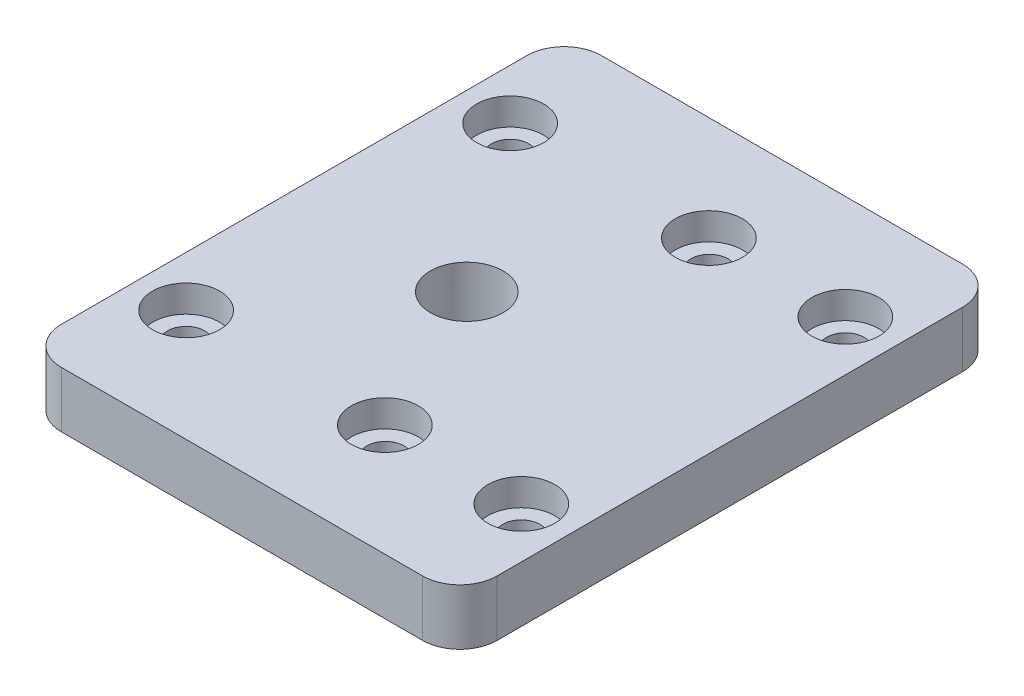
ISO-10303-21;
HEADER;
FILE_DESCRIPTION(('STEP AP214'),'2;1');
FILE_NAME('part.step','',(''),(''),'','','');
FILE_SCHEMA(('AUTOMOTIVE_DESIGN { 1 0 10303 214 1 1 1 1 }'));
ENDSEC;
DATA;
#1=APPLICATION_CONTEXT('core data for automotive mechanical design processes');
#2=APPLICATION_PROTOCOL_DEFINITION('international standard','automotive_design',2000,#1);
#3=PRODUCT_CONTEXT('',#1,'mechanical');
#4=PRODUCT('Part','Part','',(#3));
#5=PRODUCT_RELATED_PRODUCT_CATEGORY('part','',(#4));
#6=PRODUCT_DEFINITION_FORMATION('','',#4);
#7=PRODUCT_DEFINITION_CONTEXT('part definition',#1,'design');
#8=PRODUCT_DEFINITION('design','',#6,#7);
#9=PRODUCT_DEFINITION_SHAPE('','',#8);
#10=(LENGTH_UNIT() NAMED_UNIT(*) SI_UNIT(.MILLI.,.METRE.));
#11=(NAMED_UNIT(*) PLANE_ANGLE_UNIT() SI_UNIT($,.RADIAN.));
#12=(NAMED_UNIT(*) SI_UNIT($,.STERADIAN.) SOLID_ANGLE_UNIT());
#13=UNCERTAINTY_MEASURE_WITH_UNIT(LENGTH_MEASURE(1.E-05),#10,'distance_accuracy_value','');
#14=(GEOMETRIC_REPRESENTATION_CONTEXT(3) GLOBAL_UNCERTAINTY_ASSIGNED_CONTEXT((#13)) GLOBAL_UNIT_ASSIGNED_CONTEXT((#10,
#11,#12)) REPRESENTATION_CONTEXT('',''));
#15=CARTESIAN_POINT('',(0.,0.,0.));
#16=DIRECTION('',(0.,0.,1.));
#17=DIRECTION('',(1.,0.,0.));
#18=AXIS2_PLACEMENT_3D('',#15,#16,#17);
#19=CARTESIAN_POINT('',(-9.,-7.,-8.9));
#20=DIRECTION('',(0.,1.,0.));
#21=DIRECTION('',(0.,0.,1.));
#22=AXIS2_PLACEMENT_3D('',#19,#20,#21);
#23=CYLINDRICAL_SURFACE('',#22,1.);
#24=CARTESIAN_POINT('',(-9.,0.,-8.9));
#25=DIRECTION('',(0.,-1.,0.));
#26=DIRECTION('',(0.,0.,-1.));
#27=AXIS2_PLACEMENT_3D('',#24,#25,#26);
#28=CIRCLE('',#27,1.);
#29=CARTESIAN_POINT('',(-9.,0.,-9.9));
#30=VERTEX_POINT('',#29);
#31=EDGE_CURVE('E167',#30,#30,#28,.T.);
#32=ORIENTED_EDGE('',*,*,#31,.T.);
#33=EDGE_LOOP('',(#32));
#34=FACE_BOUND('',#33,.T.);
#35=CARTESIAN_POINT('',(-9.,1.55,-8.9));
#36=DIRECTION('',(0.,1.,0.));
#37=DIRECTION('',(0.,0.,1.));
#38=AXIS2_PLACEMENT_3D('',#35,#36,#37);
#39=CIRCLE('',#38,1.);
#40=CARTESIAN_POINT('',(-9.,1.55,-7.9));
#41=VERTEX_POINT('',#40);
#42=EDGE_CURVE('E38',#41,#41,#39,.F.);
#43=ORIENTED_EDGE('',*,*,#42,.F.);
#44=EDGE_LOOP('',(#43));
#45=FACE_BOUND('',#44,.T.);
#46=ADVANCED_FACE('F34',(#34,#45),#23,.F.);
#47=CARTESIAN_POINT('',(1.7,-7.,-8.9));
#48=DIRECTION('',(0.,1.,0.));
#49=DIRECTION('',(0.,0.,1.));
#50=AXIS2_PLACEMENT_3D('',#47,#48,#49);
#51=CYLINDRICAL_SURFACE('',#50,1.);
#52=CARTESIAN_POINT('',(1.7,0.,-8.9));
#53=DIRECTION('',(0.,-1.,0.));
#54=DIRECTION('',(0.,0.,-1.));
#55=AXIS2_PLACEMENT_3D('',#52,#53,#54);
#56=CIRCLE('',#55,1.);
#57=CARTESIAN_POINT('',(1.7,0.,-9.9));
#58=VERTEX_POINT('',#57);
#59=EDGE_CURVE('E163',#58,#58,#56,.T.);
#60=ORIENTED_EDGE('',*,*,#59,.T.);
#61=EDGE_LOOP('',(#60));
#62=FACE_BOUND('',#61,.T.);
#63=CARTESIAN_POINT('',(1.7,1.55,-8.9));
#64=DIRECTION('',(0.,1.,0.));
#65=DIRECTION('',(0.,0.,1.));
#66=AXIS2_PLACEMENT_3D('',#63,#64,#65);
#67=CIRCLE('',#66,1.);
#68=CARTESIAN_POINT('',(1.7,1.55,-7.9));
#69=VERTEX_POINT('',#68);
#70=EDGE_CURVE('E192',#69,#69,#67,.F.);
#71=ORIENTED_EDGE('',*,*,#70,.F.);
#72=EDGE_LOOP('',(#71));
#73=FACE_BOUND('',#72,.T.);
#74=ADVANCED_FACE('F271',(#62,#73),#51,.F.);
#75=CARTESIAN_POINT('',(9.,3.,-8.9));
#76=DIRECTION('',(0.,-1.,0.));
#77=DIRECTION('',(0.,0.,-1.));
#78=AXIS2_PLACEMENT_3D('',#75,#76,#77);
#79=CYLINDRICAL_SURFACE('',#78,1.);
#80=CARTESIAN_POINT('',(9.,0.,-8.9));
#81=DIRECTION('',(0.,1.,0.));
#82=DIRECTION('',(0.,0.,1.));
#83=AXIS2_PLACEMENT_3D('',#80,#81,#82);
#84=CIRCLE('',#83,1.);
#85=CARTESIAN_POINT('',(9.,0.,-7.9));
#86=VERTEX_POINT('',#85);
#87=EDGE_CURVE('E229',#86,#86,#84,.T.);
#88=ORIENTED_EDGE('',*,*,#87,.F.);
#89=EDGE_LOOP('',(#88));
#90=FACE_BOUND('',#89,.T.);
#91=CARTESIAN_POINT('',(9.,1.55,-8.9));
#92=DIRECTION('',(0.,1.,0.));
#93=DIRECTION('',(0.,0.,1.));
#94=AXIS2_PLACEMENT_3D('',#91,#92,#93);
#95=CIRCLE('',#94,1.);
#96=CARTESIAN_POINT('',(9.,1.55,-7.9));
#97=VERTEX_POINT('',#96);
#98=EDGE_CURVE('E188',#97,#97,#95,.T.);
#99=ORIENTED_EDGE('',*,*,#98,.T.);
#100=EDGE_LOOP('',(#99));
#101=FACE_BOUND('',#100,.T.);
#102=ADVANCED_FACE('F277',(#90,#101),#79,.F.);
#103=CARTESIAN_POINT('',(9.,3.,8.5));
#104=DIRECTION('',(0.,-1.,0.));
#105=DIRECTION('',(0.,0.,-1.));
#106=AXIS2_PLACEMENT_3D('',#103,#104,#105);
#107=CYLINDRICAL_SURFACE('',#106,1.);
#108=CARTESIAN_POINT('',(9.,0.,8.5));
#109=DIRECTION('',(0.,1.,0.));
#110=DIRECTION('',(0.,0.,-1.));
#111=AXIS2_PLACEMENT_3D('',#108,#109,#110);
#112=CIRCLE('',#111,1.);
#113=CARTESIAN_POINT('',(9.,0.,7.5));
#114=VERTEX_POINT('',#113);
#115=EDGE_CURVE('E135',#114,#114,#112,.T.);
#116=ORIENTED_EDGE('',*,*,#115,.F.);
#117=EDGE_LOOP('',(#116));
#118=FACE_BOUND('',#117,.T.);
#119=CARTESIAN_POINT('',(9.,1.55,8.5));
#120=DIRECTION('',(0.,1.,0.));
#121=DIRECTION('',(0.,0.,1.));
#122=AXIS2_PLACEMENT_3D('',#119,#120,#121);
#123=CIRCLE('',#122,1.);
#124=CARTESIAN_POINT('',(9.,1.55,9.5));
#125=VERTEX_POINT('',#124);
#126=EDGE_CURVE('E183',#125,#125,#123,.T.);
#127=ORIENTED_EDGE('',*,*,#126,.T.);
#128=EDGE_LOOP('',(#127));
#129=FACE_BOUND('',#128,.T.);
#130=ADVANCED_FACE('F287',(#118,#129),#107,.F.);
#131=CARTESIAN_POINT('',(1.7,3.,8.5));
#132=DIRECTION('',(0.,-1.,0.));
#133=DIRECTION('',(0.,0.,-1.));
#134=AXIS2_PLACEMENT_3D('',#131,#132,#133);
#135=CYLINDRICAL_SURFACE('',#134,1.);
#136=CARTESIAN_POINT('',(1.7,0.,8.5));
#137=DIRECTION('',(0.,1.,0.));
#138=DIRECTION('',(0.,0.,-1.));
#139=AXIS2_PLACEMENT_3D('',#136,#137,#138);
#140=CIRCLE('',#139,1.);
#141=CARTESIAN_POINT('',(1.7,0.,7.5));
#142=VERTEX_POINT('',#141);
#143=EDGE_CURVE('E166',#142,#142,#140,.T.);
#144=ORIENTED_EDGE('',*,*,#143,.F.);
#145=EDGE_LOOP('',(#144));
#146=FACE_BOUND('',#145,.T.);
#147=CARTESIAN_POINT('',(1.7,1.55,8.5));
#148=DIRECTION('',(0.,1.,0.));
#149=DIRECTION('',(0.,0.,1.));
#150=AXIS2_PLACEMENT_3D('',#147,#148,#149);
#151=CIRCLE('',#150,1.);
#152=CARTESIAN_POINT('',(1.7,1.55,9.5));
#153=VERTEX_POINT('',#152);
#154=EDGE_CURVE('E178',#153,#153,#151,.T.);
#155=ORIENTED_EDGE('',*,*,#154,.T.);
#156=EDGE_LOOP('',(#155));
#157=FACE_BOUND('',#156,.T.);
#158=ADVANCED_FACE('F283',(#146,#157),#135,.F.);
#159=CARTESIAN_POINT('',(-9.,3.,8.5));
#160=DIRECTION('',(0.,-1.,0.));
#161=DIRECTION('',(0.,0.,-1.));
#162=AXIS2_PLACEMENT_3D('',#159,#160,#161);
#163=CYLINDRICAL_SURFACE('',#162,1.);
#164=CARTESIAN_POINT('',(-9.,0.,8.5));
#165=DIRECTION('',(0.,1.,0.));
#166=DIRECTION('',(0.,0.,-1.));
#167=AXIS2_PLACEMENT_3D('',#164,#165,#166);
#168=CIRCLE('',#167,1.);
#169=CARTESIAN_POINT('',(-9.,0.,7.5));
#170=VERTEX_POINT('',#169);
#171=EDGE_CURVE('E232',#170,#170,#168,.T.);
#172=ORIENTED_EDGE('',*,*,#171,.F.);
#173=EDGE_LOOP('',(#172));
#174=FACE_BOUND('',#173,.T.);
#175=CARTESIAN_POINT('',(-9.,1.55,8.5));
#176=DIRECTION('',(0.,1.,0.));
#177=DIRECTION('',(0.,0.,1.));
#178=AXIS2_PLACEMENT_3D('',#175,#176,#177);
#179=CIRCLE('',#178,1.);
#180=CARTESIAN_POINT('',(-9.,1.55,9.5));
#181=VERTEX_POINT('',#180);
#182=EDGE_CURVE('E174',#181,#181,#179,.T.);
#183=ORIENTED_EDGE('',*,*,#182,.T.);
#184=EDGE_LOOP('',(#183));
#185=FACE_BOUND('',#184,.T.);
#186=ADVANCED_FACE('F286',(#174,#185),#163,.F.);
#187=CARTESIAN_POINT('',(0.,3.,0.));
#188=DIRECTION('',(0.,-1.,0.));
#189=DIRECTION('',(0.,0.,-1.));
#190=AXIS2_PLACEMENT_3D('',#187,#188,#189);
#191=PLANE('',#190);
#192=CARTESIAN_POINT('',(-9.,3.,-8.9));
#193=DIRECTION('',(0.,1.,0.));
#194=DIRECTION('',(0.,0.,1.));
#195=AXIS2_PLACEMENT_3D('',#192,#193,#194);
#196=CIRCLE('',#195,1.8);
#197=CARTESIAN_POINT('',(-9.,3.,-7.1));
#198=VERTEX_POINT('',#197);
#199=EDGE_CURVE('E208',#198,#198,#196,.T.);
#200=ORIENTED_EDGE('',*,*,#199,.F.);
#201=EDGE_LOOP('',(#200));
#202=FACE_BOUND('',#201,.T.);
#203=CARTESIAN_POINT('',(1.67182258338477,3.,-8.89999999999191));
#204=DIRECTION('',(0.,1.,0.));
#205=DIRECTION('',(0.,0.,1.));
#206=AXIS2_PLACEMENT_3D('',#203,#204,#205);
#207=CIRCLE('',#206,1.80000000000306);
#208=CARTESIAN_POINT('',(1.67182258338477,3.,-7.09999999998885));
#209=VERTEX_POINT('',#208);
#210=EDGE_CURVE('E201',#209,#209,#207,.T.);
#211=ORIENTED_EDGE('',*,*,#210,.F.);
#212=EDGE_LOOP('',(#211));
#213=FACE_BOUND('',#212,.T.);
#214=CARTESIAN_POINT('',(9.,3.,-8.9));
#215=DIRECTION('',(0.,1.,0.));
#216=DIRECTION('',(0.,0.,1.));
#217=AXIS2_PLACEMENT_3D('',#214,#215,#216);
#218=CIRCLE('',#217,1.8);
#219=CARTESIAN_POINT('',(9.,3.,-7.1));
#220=VERTEX_POINT('',#219);
#221=EDGE_CURVE('E194',#220,#220,#218,.T.);
#222=ORIENTED_EDGE('',*,*,#221,.F.);
#223=EDGE_LOOP('',(#222));
#224=FACE_BOUND('',#223,.T.);
#225=CARTESIAN_POINT('',(9.,3.,8.5));
#226=DIRECTION('',(0.,1.,0.));
#227=DIRECTION('',(0.,0.,1.));
#228=AXIS2_PLACEMENT_3D('',#225,#226,#227);
#229=CIRCLE('',#228,1.8);
#230=CARTESIAN_POINT('',(9.,3.,10.3));
#231=VERTEX_POINT('',#230);
#232=EDGE_CURVE('E190',#231,#231,#229,.T.);
#233=ORIENTED_EDGE('',*,*,#232,.F.);
#234=EDGE_LOOP('',(#233));
#235=FACE_BOUND('',#234,.T.);
#236=CARTESIAN_POINT('',(1.67182258337933,3.,8.50000000000803));
#237=DIRECTION('',(0.,1.,0.));
#238=DIRECTION('',(0.,0.,1.));
#239=AXIS2_PLACEMENT_3D('',#236,#237,#238);
#240=CIRCLE('',#239,1.80000000000306);
#241=CARTESIAN_POINT('',(1.67182258337933,3.,10.3000000000111));
#242=VERTEX_POINT('',#241);
#243=EDGE_CURVE('E186',#242,#242,#240,.T.);
#244=ORIENTED_EDGE('',*,*,#243,.F.);
#245=EDGE_LOOP('',(#244));
#246=FACE_BOUND('',#245,.T.);
#247=CARTESIAN_POINT('',(-9.,3.,8.5));
#248=DIRECTION('',(0.,1.,0.));
#249=DIRECTION('',(0.,0.,1.));
#250=AXIS2_PLACEMENT_3D('',#247,#248,#249);
#251=CIRCLE('',#250,1.8);
#252=CARTESIAN_POINT('',(-9.,3.,10.3));
#253=VERTEX_POINT('',#252);
#254=EDGE_CURVE('E181',#253,#253,#251,.T.);
#255=ORIENTED_EDGE('',*,*,#254,.F.);
#256=EDGE_LOOP('',(#255));
#257=FACE_BOUND('',#256,.T.);
#258=CARTESIAN_POINT('',(-2.3281774166205,3.,0.100000000001835));
#259=DIRECTION('',(0.,1.,0.));
#260=DIRECTION('',(0.,0.,1.));
#261=AXIS2_PLACEMENT_3D('',#258,#259,#260);
#262=CIRCLE('',#261,1.95);
#263=CARTESIAN_POINT('',(-2.3281774166205,3.,2.05000000000184));
#264=VERTEX_POINT('',#263);
#265=EDGE_CURVE('E173',#264,#264,#262,.T.);
#266=ORIENTED_EDGE('',*,*,#265,.F.);
#267=EDGE_LOOP('',(#266));
#268=FACE_BOUND('',#267,.T.);
#269=DIRECTION('',(0.,0.,-1.));
#270=VECTOR('',#269,1.);
#271=CARTESIAN_POINT('',(11.7,3.,14.5));
#272=LINE('',#271,#270);
#273=CARTESIAN_POINT('',(11.7,3.,12.5));
#274=VERTEX_POINT('',#273);
#275=CARTESIAN_POINT('',(11.7,3.,-12.5));
#276=VERTEX_POINT('',#275);
#277=EDGE_CURVE('E140',#274,#276,#272,.T.);
#278=ORIENTED_EDGE('',*,*,#277,.T.);
#279=CARTESIAN_POINT('',(9.69999999999999,3.,-12.5));
#280=DIRECTION('',(0.,-1.,0.));
#281=DIRECTION('',(0.,0.,-1.));
#282=AXIS2_PLACEMENT_3D('',#279,#280,#281);
#283=CIRCLE('',#282,2.);
#284=CARTESIAN_POINT('',(9.69999999999999,3.,-14.5));
#285=VERTEX_POINT('',#284);
#286=EDGE_CURVE('E155',#276,#285,#283,.F.);
#287=ORIENTED_EDGE('',*,*,#286,.T.);
#288=DIRECTION('',(-1.,0.,0.));
#289=VECTOR('',#288,1.);
#290=CARTESIAN_POINT('',(-11.7,3.,-14.5));
#291=LINE('',#290,#289);
#292=CARTESIAN_POINT('',(-9.7,3.,-14.5));
#293=VERTEX_POINT('',#292);
#294=EDGE_CURVE('E122',#285,#293,#291,.T.);
#295=ORIENTED_EDGE('',*,*,#294,.T.);
#296=CARTESIAN_POINT('',(-9.7,3.,-12.5));
#297=DIRECTION('',(0.,-1.,0.));
#298=DIRECTION('',(0.,0.,-1.));
#299=AXIS2_PLACEMENT_3D('',#296,#297,#298);
#300=CIRCLE('',#299,2.);
#301=CARTESIAN_POINT('',(-11.7,3.,-12.5));
#302=VERTEX_POINT('',#301);
#303=EDGE_CURVE('E150',#293,#302,#300,.F.);
#304=ORIENTED_EDGE('',*,*,#303,.T.);
#305=DIRECTION('',(0.,0.,1.));
#306=VECTOR('',#305,1.);
#307=CARTESIAN_POINT('',(-11.7,3.,14.5));
#308=LINE('',#307,#306);
#309=CARTESIAN_POINT('',(-11.7,3.,12.5));
#310=VERTEX_POINT('',#309);
#311=EDGE_CURVE('E240',#302,#310,#308,.T.);
#312=ORIENTED_EDGE('',*,*,#311,.T.);
#313=CARTESIAN_POINT('',(-9.7,3.,12.5));
#314=DIRECTION('',(0.,-1.,0.));
#315=DIRECTION('',(0.,0.,-1.));
#316=AXIS2_PLACEMENT_3D('',#313,#314,#315);
#317=CIRCLE('',#316,2.);
#318=CARTESIAN_POINT('',(-9.7,3.,14.5));
#319=VERTEX_POINT('',#318);
#320=EDGE_CURVE('E58',#310,#319,#317,.F.);
#321=ORIENTED_EDGE('',*,*,#320,.T.);
#322=DIRECTION('',(1.,0.,0.));
#323=VECTOR('',#322,1.);
#324=CARTESIAN_POINT('',(-11.7,3.,14.5));
#325=LINE('',#324,#323);
#326=CARTESIAN_POINT('',(9.69999999999999,3.,14.5));
#327=VERTEX_POINT('',#326);
#328=EDGE_CURVE('E141',#319,#327,#325,.T.);
#329=ORIENTED_EDGE('',*,*,#328,.T.);
#330=CARTESIAN_POINT('',(9.7,3.,12.5));
#331=DIRECTION('',(0.,-1.,0.));
#332=DIRECTION('',(0.,0.,-1.));
#333=AXIS2_PLACEMENT_3D('',#330,#331,#332);
#334=CIRCLE('',#333,2.);
#335=EDGE_CURVE('E153',#327,#274,#334,.F.);
#336=ORIENTED_EDGE('',*,*,#335,.T.);
#337=EDGE_LOOP('',(#278,#287,#295,#304,#312,#321,#329,#336));
#338=FACE_BOUND('',#337,.T.);
#339=ADVANCED_FACE('F242',(#202,#213,#224,#235,#246,#257,#268,#338),#191,.F.);
#340=CARTESIAN_POINT('',(0.,0.,0.));
#341=DIRECTION('',(0.,-1.,0.));
#342=DIRECTION('',(0.,0.,-1.));
#343=AXIS2_PLACEMENT_3D('',#340,#341,#342);
#344=PLANE('',#343);
#345=CARTESIAN_POINT('',(-2.3281774166205,0.,0.100000000001835));
#346=DIRECTION('',(0.,-1.,0.));
#347=DIRECTION('',(0.,0.,-1.));
#348=AXIS2_PLACEMENT_3D('',#345,#346,#347);
#349=CIRCLE('',#348,1.95);
#350=CARTESIAN_POINT('',(-2.3281774166205,0.,-1.84999999999817));
#351=VERTEX_POINT('',#350);
#352=EDGE_CURVE('E170',#351,#351,#349,.T.);
#353=ORIENTED_EDGE('',*,*,#352,.F.);
#354=EDGE_LOOP('',(#353));
#355=FACE_BOUND('',#354,.T.);
#356=ORIENTED_EDGE('',*,*,#31,.F.);
#357=EDGE_LOOP('',(#356));
#358=FACE_BOUND('',#357,.T.);
#359=ORIENTED_EDGE('',*,*,#59,.F.);
#360=EDGE_LOOP('',(#359));
#361=FACE_BOUND('',#360,.T.);
#362=ORIENTED_EDGE('',*,*,#87,.T.);
#363=EDGE_LOOP('',(#362));
#364=FACE_BOUND('',#363,.T.);
#365=ORIENTED_EDGE('',*,*,#115,.T.);
#366=EDGE_LOOP('',(#365));
#367=FACE_BOUND('',#366,.T.);
#368=DIRECTION('',(-1.,0.,0.));
#369=VECTOR('',#368,1.);
#370=CARTESIAN_POINT('',(-11.7,0.,-14.5));
#371=LINE('',#370,#369);
#372=CARTESIAN_POINT('',(9.69999999999999,0.,-14.5));
#373=VERTEX_POINT('',#372);
#374=CARTESIAN_POINT('',(-9.7,0.,-14.5));
#375=VERTEX_POINT('',#374);
#376=EDGE_CURVE('E119',#373,#375,#371,.T.);
#377=ORIENTED_EDGE('',*,*,#376,.F.);
#378=CARTESIAN_POINT('',(9.69999999999999,0.,-12.5));
#379=DIRECTION('',(0.,-1.,0.));
#380=DIRECTION('',(0.,0.,-1.));
#381=AXIS2_PLACEMENT_3D('',#378,#379,#380);
#382=CIRCLE('',#381,2.);
#383=CARTESIAN_POINT('',(11.7,0.,-12.5));
#384=VERTEX_POINT('',#383);
#385=EDGE_CURVE('E102',#373,#384,#382,.T.);
#386=ORIENTED_EDGE('',*,*,#385,.T.);
#387=DIRECTION('',(0.,0.,-1.));
#388=VECTOR('',#387,1.);
#389=CARTESIAN_POINT('',(11.7,0.,14.5));
#390=LINE('',#389,#388);
#391=CARTESIAN_POINT('',(11.7,0.,12.5));
#392=VERTEX_POINT('',#391);
#393=EDGE_CURVE('E130',#392,#384,#390,.T.);
#394=ORIENTED_EDGE('',*,*,#393,.F.);
#395=CARTESIAN_POINT('',(9.7,0.,12.5));
#396=DIRECTION('',(0.,-1.,0.));
#397=DIRECTION('',(0.,0.,-1.));
#398=AXIS2_PLACEMENT_3D('',#395,#396,#397);
#399=CIRCLE('',#398,2.);
#400=CARTESIAN_POINT('',(9.69999999999999,0.,14.5));
#401=VERTEX_POINT('',#400);
#402=EDGE_CURVE('E113',#392,#401,#399,.T.);
#403=ORIENTED_EDGE('',*,*,#402,.T.);
#404=DIRECTION('',(1.,0.,0.));
#405=VECTOR('',#404,1.);
#406=CARTESIAN_POINT('',(-11.7,0.,14.5));
#407=LINE('',#406,#405);
#408=CARTESIAN_POINT('',(-9.7,0.,14.5));
#409=VERTEX_POINT('',#408);
#410=EDGE_CURVE('E133',#409,#401,#407,.T.);
#411=ORIENTED_EDGE('',*,*,#410,.F.);
#412=CARTESIAN_POINT('',(-9.7,0.,12.5));
#413=DIRECTION('',(0.,-1.,0.));
#414=DIRECTION('',(0.,0.,-1.));
#415=AXIS2_PLACEMENT_3D('',#412,#413,#414);
#416=CIRCLE('',#415,2.);
#417=CARTESIAN_POINT('',(-11.7,0.,12.5));
#418=VERTEX_POINT('',#417);
#419=EDGE_CURVE('E144',#409,#418,#416,.T.);
#420=ORIENTED_EDGE('',*,*,#419,.T.);
#421=DIRECTION('',(0.,0.,1.));
#422=VECTOR('',#421,1.);
#423=CARTESIAN_POINT('',(-11.7,0.,14.5));
#424=LINE('',#423,#422);
#425=CARTESIAN_POINT('',(-11.7,0.,-12.5));
#426=VERTEX_POINT('',#425);
#427=EDGE_CURVE('E129',#426,#418,#424,.T.);
#428=ORIENTED_EDGE('',*,*,#427,.F.);
#429=CARTESIAN_POINT('',(-9.7,0.,-12.5));
#430=DIRECTION('',(0.,-1.,0.));
#431=DIRECTION('',(0.,0.,-1.));
#432=AXIS2_PLACEMENT_3D('',#429,#430,#431);
#433=CIRCLE('',#432,2.);
#434=EDGE_CURVE('E123',#426,#375,#433,.T.);
#435=ORIENTED_EDGE('',*,*,#434,.T.);
#436=EDGE_LOOP('',(#377,#386,#394,#403,#411,#420,#428,#435));
#437=FACE_BOUND('',#436,.T.);
#438=ORIENTED_EDGE('',*,*,#171,.T.);
#439=EDGE_LOOP('',(#438));
#440=FACE_BOUND('',#439,.T.);
#441=ORIENTED_EDGE('',*,*,#143,.T.);
#442=EDGE_LOOP('',(#441));
#443=FACE_BOUND('',#442,.T.);
#444=ADVANCED_FACE('F126',(#355,#358,#361,#364,#367,#437,#440,#443),#344,.T.);
#445=CARTESIAN_POINT('',(11.7,3.,14.5));
#446=DIRECTION('',(-1.,0.,0.));
#447=DIRECTION('',(0.,0.,1.));
#448=AXIS2_PLACEMENT_3D('',#445,#446,#447);
#449=PLANE('',#448);
#450=ORIENTED_EDGE('',*,*,#393,.T.);
#451=DIRECTION('',(0.,-1.,0.));
#452=VECTOR('',#451,1.);
#453=CARTESIAN_POINT('',(11.7,3.,-12.5));
#454=LINE('',#453,#452);
#455=EDGE_CURVE('E107',#384,#276,#454,.F.);
#456=ORIENTED_EDGE('',*,*,#455,.T.);
#457=ORIENTED_EDGE('',*,*,#277,.F.);
#458=DIRECTION('',(0.,-1.,0.));
#459=VECTOR('',#458,1.);
#460=CARTESIAN_POINT('',(11.7,3.,12.5));
#461=LINE('',#460,#459);
#462=EDGE_CURVE('E112',#274,#392,#461,.T.);
#463=ORIENTED_EDGE('',*,*,#462,.T.);
#464=EDGE_LOOP('',(#450,#456,#457,#463));
#465=FACE_BOUND('',#464,.T.);
#466=ADVANCED_FACE('F249',(#465),#449,.F.);
#467=CARTESIAN_POINT('',(-11.7,3.,-14.5));
#468=DIRECTION('',(0.,0.,1.));
#469=DIRECTION('',(1.,0.,0.));
#470=AXIS2_PLACEMENT_3D('',#467,#468,#469);
#471=PLANE('',#470);
#472=ORIENTED_EDGE('',*,*,#294,.F.);
#473=DIRECTION('',(0.,-1.,0.));
#474=VECTOR('',#473,1.);
#475=CARTESIAN_POINT('',(9.69999999999999,3.,-14.5));
#476=LINE('',#475,#474);
#477=EDGE_CURVE('E106',#285,#373,#476,.T.);
#478=ORIENTED_EDGE('',*,*,#477,.T.);
#479=ORIENTED_EDGE('',*,*,#376,.T.);
#480=DIRECTION('',(0.,-1.,0.));
#481=VECTOR('',#480,1.);
#482=CARTESIAN_POINT('',(-9.7,3.,-14.5));
#483=LINE('',#482,#481);
#484=EDGE_CURVE('E124',#375,#293,#483,.F.);
#485=ORIENTED_EDGE('',*,*,#484,.T.);
#486=EDGE_LOOP('',(#472,#478,#479,#485));
#487=FACE_BOUND('',#486,.T.);
#488=ADVANCED_FACE('F118',(#487),#471,.F.);
#489=CARTESIAN_POINT('',(-11.7,3.,14.5));
#490=DIRECTION('',(1.,0.,0.));
#491=DIRECTION('',(0.,0.,-1.));
#492=AXIS2_PLACEMENT_3D('',#489,#490,#491);
#493=PLANE('',#492);
#494=ORIENTED_EDGE('',*,*,#427,.T.);
#495=DIRECTION('',(0.,-1.,0.));
#496=VECTOR('',#495,1.);
#497=CARTESIAN_POINT('',(-11.7,3.,12.5));
#498=LINE('',#497,#496);
#499=EDGE_CURVE('E11',#418,#310,#498,.F.);
#500=ORIENTED_EDGE('',*,*,#499,.T.);
#501=ORIENTED_EDGE('',*,*,#311,.F.);
#502=DIRECTION('',(0.,-1.,0.));
#503=VECTOR('',#502,1.);
#504=CARTESIAN_POINT('',(-11.7,3.,-12.5));
#505=LINE('',#504,#503);
#506=EDGE_CURVE('E43',#302,#426,#505,.T.);
#507=ORIENTED_EDGE('',*,*,#506,.T.);
#508=EDGE_LOOP('',(#494,#500,#501,#507));
#509=FACE_BOUND('',#508,.T.);
#510=ADVANCED_FACE('F256',(#509),#493,.F.);
#511=CARTESIAN_POINT('',(-11.7,3.,14.5));
#512=DIRECTION('',(0.,0.,-1.));
#513=DIRECTION('',(-1.,0.,0.));
#514=AXIS2_PLACEMENT_3D('',#511,#512,#513);
#515=PLANE('',#514);
#516=ORIENTED_EDGE('',*,*,#410,.T.);
#517=DIRECTION('',(0.,-1.,0.));
#518=VECTOR('',#517,1.);
#519=CARTESIAN_POINT('',(9.69999999999999,3.,14.5));
#520=LINE('',#519,#518);
#521=EDGE_CURVE('E51',#401,#327,#520,.F.);
#522=ORIENTED_EDGE('',*,*,#521,.T.);
#523=ORIENTED_EDGE('',*,*,#328,.F.);
#524=DIRECTION('',(0.,-1.,0.));
#525=VECTOR('',#524,1.);
#526=CARTESIAN_POINT('',(-9.7,3.,14.5));
#527=LINE('',#526,#525);
#528=EDGE_CURVE('E157',#319,#409,#527,.T.);
#529=ORIENTED_EDGE('',*,*,#528,.T.);
#530=EDGE_LOOP('',(#516,#522,#523,#529));
#531=FACE_BOUND('',#530,.T.);
#532=ADVANCED_FACE('F251',(#531),#515,.F.);
#533=CARTESIAN_POINT('',(9.69999999999999,3.,-12.5));
#534=DIRECTION('',(0.,-1.,0.));
#535=DIRECTION('',(0.,0.,-1.));
#536=AXIS2_PLACEMENT_3D('',#533,#534,#535);
#537=CYLINDRICAL_SURFACE('',#536,2.);
#538=ORIENTED_EDGE('',*,*,#286,.F.);
#539=ORIENTED_EDGE('',*,*,#455,.F.);
#540=ORIENTED_EDGE('',*,*,#385,.F.);
#541=ORIENTED_EDGE('',*,*,#477,.F.);
#542=EDGE_LOOP('',(#538,#539,#540,#541));
#543=FACE_BOUND('',#542,.T.);
#544=ADVANCED_FACE('F105',(#543),#537,.T.);
#545=CARTESIAN_POINT('',(9.7,3.,12.5));
#546=DIRECTION('',(0.,-1.,0.));
#547=DIRECTION('',(0.,0.,-1.));
#548=AXIS2_PLACEMENT_3D('',#545,#546,#547);
#549=CYLINDRICAL_SURFACE('',#548,2.);
#550=ORIENTED_EDGE('',*,*,#335,.F.);
#551=ORIENTED_EDGE('',*,*,#521,.F.);
#552=ORIENTED_EDGE('',*,*,#402,.F.);
#553=ORIENTED_EDGE('',*,*,#462,.F.);
#554=EDGE_LOOP('',(#550,#551,#552,#553));
#555=FACE_BOUND('',#554,.T.);
#556=ADVANCED_FACE('F247',(#555),#549,.T.);
#557=CARTESIAN_POINT('',(-9.7,3.,12.5));
#558=DIRECTION('',(0.,-1.,0.));
#559=DIRECTION('',(0.,0.,-1.));
#560=AXIS2_PLACEMENT_3D('',#557,#558,#559);
#561=CYLINDRICAL_SURFACE('',#560,2.);
#562=ORIENTED_EDGE('',*,*,#320,.F.);
#563=ORIENTED_EDGE('',*,*,#499,.F.);
#564=ORIENTED_EDGE('',*,*,#419,.F.);
#565=ORIENTED_EDGE('',*,*,#528,.F.);
#566=EDGE_LOOP('',(#562,#563,#564,#565));
#567=FACE_BOUND('',#566,.T.);
#568=ADVANCED_FACE('F253',(#567),#561,.T.);
#569=CARTESIAN_POINT('',(-9.7,3.,-12.5));
#570=DIRECTION('',(0.,-1.,0.));
#571=DIRECTION('',(0.,0.,-1.));
#572=AXIS2_PLACEMENT_3D('',#569,#570,#571);
#573=CYLINDRICAL_SURFACE('',#572,2.);
#574=ORIENTED_EDGE('',*,*,#303,.F.);
#575=ORIENTED_EDGE('',*,*,#484,.F.);
#576=ORIENTED_EDGE('',*,*,#434,.F.);
#577=ORIENTED_EDGE('',*,*,#506,.F.);
#578=EDGE_LOOP('',(#574,#575,#576,#577));
#579=FACE_BOUND('',#578,.T.);
#580=ADVANCED_FACE('F36',(#579),#573,.T.);
#581=CARTESIAN_POINT('',(-2.3281774166205,-7.,0.100000000001835));
#582=DIRECTION('',(0.,1.,0.));
#583=DIRECTION('',(0.,0.,1.));
#584=AXIS2_PLACEMENT_3D('',#581,#582,#583);
#585=CYLINDRICAL_SURFACE('',#584,1.95);
#586=ORIENTED_EDGE('',*,*,#352,.T.);
#587=EDGE_LOOP('',(#586));
#588=FACE_BOUND('',#587,.T.);
#589=ORIENTED_EDGE('',*,*,#265,.T.);
#590=EDGE_LOOP('',(#589));
#591=FACE_BOUND('',#590,.T.);
#592=ADVANCED_FACE('F262',(#588,#591),#585,.F.);
#593=CARTESIAN_POINT('',(-9.,1.55,8.5));
#594=DIRECTION('',(0.,1.,0.));
#595=DIRECTION('',(0.,0.,1.));
#596=AXIS2_PLACEMENT_3D('',#593,#594,#595);
#597=CYLINDRICAL_SURFACE('',#596,1.8);
#598=CARTESIAN_POINT('',(-9.,1.55,8.5));
#599=DIRECTION('',(0.,1.,0.));
#600=DIRECTION('',(0.,0.,1.));
#601=AXIS2_PLACEMENT_3D('',#598,#599,#600);
#602=CIRCLE('',#601,1.8);
#603=CARTESIAN_POINT('',(-9.,1.55,10.3));
#604=VERTEX_POINT('',#603);
#605=EDGE_CURVE('E177',#604,#604,#602,.T.);
#606=ORIENTED_EDGE('',*,*,#605,.F.);
#607=EDGE_LOOP('',(#606));
#608=FACE_BOUND('',#607,.T.);
#609=ORIENTED_EDGE('',*,*,#254,.T.);
#610=EDGE_LOOP('',(#609));
#611=FACE_BOUND('',#610,.T.);
#612=ADVANCED_FACE('F267',(#608,#611),#597,.F.);
#613=CARTESIAN_POINT('',(-9.,1.55,8.5));
#614=DIRECTION('',(0.,1.,0.));
#615=DIRECTION('',(0.,0.,1.));
#616=AXIS2_PLACEMENT_3D('',#613,#614,#615);
#617=PLANE('',#616);
#618=ORIENTED_EDGE('',*,*,#182,.F.);
#619=EDGE_LOOP('',(#618));
#620=FACE_BOUND('',#619,.T.);
#621=ORIENTED_EDGE('',*,*,#605,.T.);
#622=EDGE_LOOP('',(#621));
#623=FACE_BOUND('',#622,.T.);
#624=ADVANCED_FACE('F390',(#620,#623),#617,.T.);
#625=CARTESIAN_POINT('',(1.67182258337933,1.55,8.50000000000803));
#626=DIRECTION('',(0.,1.,0.));
#627=DIRECTION('',(0.,0.,1.));
#628=AXIS2_PLACEMENT_3D('',#625,#626,#627);
#629=CYLINDRICAL_SURFACE('',#628,1.80000000000306);
#630=CARTESIAN_POINT('',(1.67182258337933,1.55,8.50000000000803));
#631=DIRECTION('',(0.,1.,0.));
#632=DIRECTION('',(0.,0.,1.));
#633=AXIS2_PLACEMENT_3D('',#630,#631,#632);
#634=CIRCLE('',#633,1.80000000000306);
#635=CARTESIAN_POINT('',(1.67182258337933,1.55,10.3000000000111));
#636=VERTEX_POINT('',#635);
#637=EDGE_CURVE('E182',#636,#636,#634,.T.);
#638=ORIENTED_EDGE('',*,*,#637,.F.);
#639=EDGE_LOOP('',(#638));
#640=FACE_BOUND('',#639,.T.);
#641=ORIENTED_EDGE('',*,*,#243,.T.);
#642=EDGE_LOOP('',(#641));
#643=FACE_BOUND('',#642,.T.);
#644=ADVANCED_FACE('F399',(#640,#643),#629,.F.);
#645=CARTESIAN_POINT('',(1.67182258337933,1.55,8.50000000000803));
#646=DIRECTION('',(0.,1.,0.));
#647=DIRECTION('',(0.,0.,1.));
#648=AXIS2_PLACEMENT_3D('',#645,#646,#647);
#649=PLANE('',#648);
#650=ORIENTED_EDGE('',*,*,#154,.F.);
#651=EDGE_LOOP('',(#650));
#652=FACE_BOUND('',#651,.T.);
#653=ORIENTED_EDGE('',*,*,#637,.T.);
#654=EDGE_LOOP('',(#653));
#655=FACE_BOUND('',#654,.T.);
#656=ADVANCED_FACE('F409',(#652,#655),#649,.T.);
#657=CARTESIAN_POINT('',(9.,1.55,8.5));
#658=DIRECTION('',(0.,1.,0.));
#659=DIRECTION('',(0.,0.,1.));
#660=AXIS2_PLACEMENT_3D('',#657,#658,#659);
#661=CYLINDRICAL_SURFACE('',#660,1.8);
#662=CARTESIAN_POINT('',(9.,1.55,8.5));
#663=DIRECTION('',(0.,1.,0.));
#664=DIRECTION('',(0.,0.,1.));
#665=AXIS2_PLACEMENT_3D('',#662,#663,#664);
#666=CIRCLE('',#665,1.8);
#667=CARTESIAN_POINT('',(9.,1.55,10.3));
#668=VERTEX_POINT('',#667);
#669=EDGE_CURVE('E187',#668,#668,#666,.T.);
#670=ORIENTED_EDGE('',*,*,#669,.F.);
#671=EDGE_LOOP('',(#670));
#672=FACE_BOUND('',#671,.T.);
#673=ORIENTED_EDGE('',*,*,#232,.T.);
#674=EDGE_LOOP('',(#673));
#675=FACE_BOUND('',#674,.T.);
#676=ADVANCED_FACE('F419',(#672,#675),#661,.F.);
#677=CARTESIAN_POINT('',(9.,1.55,8.5));
#678=DIRECTION('',(0.,1.,0.));
#679=DIRECTION('',(0.,0.,1.));
#680=AXIS2_PLACEMENT_3D('',#677,#678,#679);
#681=PLANE('',#680);
#682=ORIENTED_EDGE('',*,*,#126,.F.);
#683=EDGE_LOOP('',(#682));
#684=FACE_BOUND('',#683,.T.);
#685=ORIENTED_EDGE('',*,*,#669,.T.);
#686=EDGE_LOOP('',(#685));
#687=FACE_BOUND('',#686,.T.);
#688=ADVANCED_FACE('F429',(#684,#687),#681,.T.);
#689=CARTESIAN_POINT('',(9.,1.55,-8.9));
#690=DIRECTION('',(0.,1.,0.));
#691=DIRECTION('',(0.,0.,1.));
#692=AXIS2_PLACEMENT_3D('',#689,#690,#691);
#693=CYLINDRICAL_SURFACE('',#692,1.8);
#694=CARTESIAN_POINT('',(9.,1.55,-8.9));
#695=DIRECTION('',(0.,1.,0.));
#696=DIRECTION('',(0.,0.,1.));
#697=AXIS2_PLACEMENT_3D('',#694,#695,#696);
#698=CIRCLE('',#697,1.8);
#699=CARTESIAN_POINT('',(9.,1.55,-7.1));
#700=VERTEX_POINT('',#699);
#701=EDGE_CURVE('E191',#700,#700,#698,.T.);
#702=ORIENTED_EDGE('',*,*,#701,.F.);
#703=EDGE_LOOP('',(#702));
#704=FACE_BOUND('',#703,.T.);
#705=ORIENTED_EDGE('',*,*,#221,.T.);
#706=EDGE_LOOP('',(#705));
#707=FACE_BOUND('',#706,.T.);
#708=ADVANCED_FACE('F439',(#704,#707),#693,.F.);
#709=CARTESIAN_POINT('',(9.,1.55,-8.9));
#710=DIRECTION('',(0.,1.,0.));
#711=DIRECTION('',(0.,0.,1.));
#712=AXIS2_PLACEMENT_3D('',#709,#710,#711);
#713=PLANE('',#712);
#714=ORIENTED_EDGE('',*,*,#98,.F.);
#715=EDGE_LOOP('',(#714));
#716=FACE_BOUND('',#715,.T.);
#717=ORIENTED_EDGE('',*,*,#701,.T.);
#718=EDGE_LOOP('',(#717));
#719=FACE_BOUND('',#718,.T.);
#720=ADVANCED_FACE('F449',(#716,#719),#713,.T.);
#721=CARTESIAN_POINT('',(1.67182258338477,1.55,-8.89999999999191));
#722=DIRECTION('',(0.,1.,0.));
#723=DIRECTION('',(0.,0.,1.));
#724=AXIS2_PLACEMENT_3D('',#721,#722,#723);
#725=PLANE('',#724);
#726=CARTESIAN_POINT('',(1.67182258338477,1.55,-8.89999999999191));
#727=DIRECTION('',(0.,1.,0.));
#728=DIRECTION('',(0.,0.,1.));
#729=AXIS2_PLACEMENT_3D('',#726,#727,#728);
#730=CIRCLE('',#729,1.80000000000306);
#731=CARTESIAN_POINT('',(1.67182258338477,1.55,-7.09999999998885));
#732=VERTEX_POINT('',#731);
#733=EDGE_CURVE('E195',#732,#732,#730,.T.);
#734=ORIENTED_EDGE('',*,*,#733,.T.);
#735=EDGE_LOOP('',(#734));
#736=FACE_BOUND('',#735,.T.);
#737=ORIENTED_EDGE('',*,*,#70,.T.);
#738=EDGE_LOOP('',(#737));
#739=FACE_BOUND('',#738,.T.);
#740=ADVANCED_FACE('F459',(#736,#739),#725,.T.);
#741=CARTESIAN_POINT('',(1.67182258338477,1.55,-8.89999999999191));
#742=DIRECTION('',(0.,1.,0.));
#743=DIRECTION('',(0.,0.,1.));
#744=AXIS2_PLACEMENT_3D('',#741,#742,#743);
#745=CYLINDRICAL_SURFACE('',#744,1.80000000000306);
#746=ORIENTED_EDGE('',*,*,#733,.F.);
#747=EDGE_LOOP('',(#746));
#748=FACE_BOUND('',#747,.T.);
#749=ORIENTED_EDGE('',*,*,#210,.T.);
#750=EDGE_LOOP('',(#749));
#751=FACE_BOUND('',#750,.T.);
#752=ADVANCED_FACE('F469',(#748,#751),#745,.F.);
#753=CARTESIAN_POINT('',(-9.,1.55,-8.9));
#754=DIRECTION('',(0.,1.,0.));
#755=DIRECTION('',(0.,0.,1.));
#756=AXIS2_PLACEMENT_3D('',#753,#754,#755);
#757=PLANE('',#756);
#758=CARTESIAN_POINT('',(-9.,1.55,-8.9));
#759=DIRECTION('',(0.,1.,0.));
#760=DIRECTION('',(0.,0.,1.));
#761=AXIS2_PLACEMENT_3D('',#758,#759,#760);
#762=CIRCLE('',#761,1.8);
#763=CARTESIAN_POINT('',(-9.,1.55,-7.1));
#764=VERTEX_POINT('',#763);
#765=EDGE_CURVE('E505',#764,#764,#762,.T.);
#766=ORIENTED_EDGE('',*,*,#765,.T.);
#767=EDGE_LOOP('',(#766));
#768=FACE_BOUND('',#767,.T.);
#769=ORIENTED_EDGE('',*,*,#42,.T.);
#770=EDGE_LOOP('',(#769));
#771=FACE_BOUND('',#770,.T.);
#772=ADVANCED_FACE('F478',(#768,#771),#757,.T.);
#773=CARTESIAN_POINT('',(-9.,1.55,-8.9));
#774=DIRECTION('',(0.,1.,0.));
#775=DIRECTION('',(0.,0.,1.));
#776=AXIS2_PLACEMENT_3D('',#773,#774,#775);
#777=CYLINDRICAL_SURFACE('',#776,1.8);
#778=ORIENTED_EDGE('',*,*,#765,.F.);
#779=EDGE_LOOP('',(#778));
#780=FACE_BOUND('',#779,.T.);
#781=ORIENTED_EDGE('',*,*,#199,.T.);
#782=EDGE_LOOP('',(#781));
#783=FACE_BOUND('',#782,.T.);
#784=ADVANCED_FACE('F488',(#780,#783),#777,.F.);
#785=CLOSED_SHELL('',(#46,#74,#102,#130,#158,#186,#339,#444,#466,#488,#510,#532,#544,#556,#568,
#580,#592,#612,#624,#644,#656,#676,#688,#708,#720,#740,#752,#772,#784));
#786=MANIFOLD_SOLID_BREP('B2',#785);
#787=ADVANCED_BREP_SHAPE_REPRESENTATION('',(#18,#786),#14);
#788=SHAPE_DEFINITION_REPRESENTATION(#9,#787);
ENDSEC;
END-ISO-10303-21;
